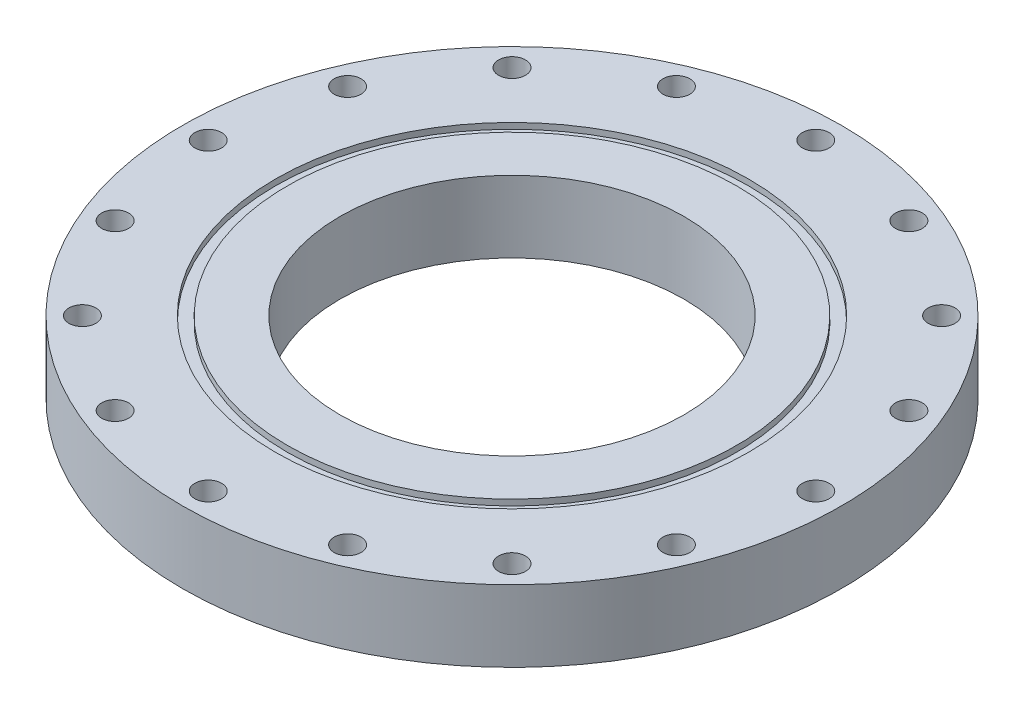
ISO-10303-21;
HEADER;
FILE_DESCRIPTION(('STEP AP214'),'2;1');
FILE_NAME('part.step','',(''),(''),'','','');
FILE_SCHEMA(('AUTOMOTIVE_DESIGN { 1 0 10303 214 1 1 1 1 }'));
ENDSEC;
DATA;
#1=APPLICATION_CONTEXT('core data for automotive mechanical design processes');
#2=APPLICATION_PROTOCOL_DEFINITION('international standard','automotive_design',2000,#1);
#3=PRODUCT_CONTEXT('',#1,'mechanical');
#4=PRODUCT('Part','Part','',(#3));
#5=PRODUCT_RELATED_PRODUCT_CATEGORY('part','',(#4));
#6=PRODUCT_DEFINITION_FORMATION('','',#4);
#7=PRODUCT_DEFINITION_CONTEXT('part definition',#1,'design');
#8=PRODUCT_DEFINITION('design','',#6,#7);
#9=PRODUCT_DEFINITION_SHAPE('','',#8);
#10=(LENGTH_UNIT() NAMED_UNIT(*) SI_UNIT(.MILLI.,.METRE.));
#11=(NAMED_UNIT(*) PLANE_ANGLE_UNIT() SI_UNIT($,.RADIAN.));
#12=(NAMED_UNIT(*) SI_UNIT($,.STERADIAN.) SOLID_ANGLE_UNIT());
#13=UNCERTAINTY_MEASURE_WITH_UNIT(LENGTH_MEASURE(1.E-05),#10,'distance_accuracy_value','');
#14=(GEOMETRIC_REPRESENTATION_CONTEXT(3) GLOBAL_UNCERTAINTY_ASSIGNED_CONTEXT((#13)) GLOBAL_UNIT_ASSIGNED_CONTEXT((#10,
#11,#12)) REPRESENTATION_CONTEXT('',''));
#15=CARTESIAN_POINT('',(0.,0.,0.));
#16=DIRECTION('',(0.,0.,1.));
#17=DIRECTION('',(1.,0.,0.));
#18=AXIS2_PLACEMENT_3D('',#15,#16,#17);
#19=CARTESIAN_POINT('',(0.,15.875,0.));
#20=DIRECTION('',(0.,1.,0.));
#21=DIRECTION('',(0.,0.,1.));
#22=AXIS2_PLACEMENT_3D('',#19,#20,#21);
#23=PLANE('',#22);
#24=CARTESIAN_POINT('',(0.,15.875,0.));
#25=DIRECTION('',(0.,1.,0.));
#26=DIRECTION('',(0.,0.,1.));
#27=AXIS2_PLACEMENT_3D('',#24,#25,#26);
#28=CIRCLE('',#27,38.1);
#29=CARTESIAN_POINT('',(0.,15.875,38.1));
#30=VERTEX_POINT('',#29);
#31=EDGE_CURVE('E49',#30,#30,#28,.T.);
#32=ORIENTED_EDGE('',*,*,#31,.F.);
#33=EDGE_LOOP('',(#32));
#34=FACE_BOUND('',#33,.T.);
#35=CARTESIAN_POINT('',(0.,15.875,0.));
#36=DIRECTION('',(0.,1.,0.));
#37=DIRECTION('',(0.,0.,1.));
#38=AXIS2_PLACEMENT_3D('',#35,#36,#37);
#39=CIRCLE('',#38,49.7967);
#40=CARTESIAN_POINT('',(0.,15.875,49.7967));
#41=VERTEX_POINT('',#40);
#42=EDGE_CURVE('E166',#41,#41,#39,.T.);
#43=ORIENTED_EDGE('',*,*,#42,.T.);
#44=EDGE_LOOP('',(#43));
#45=FACE_BOUND('',#44,.T.);
#46=ADVANCED_FACE('F35',(#34,#45),#23,.T.);
#47=CARTESIAN_POINT('',(0.,15.875,0.));
#48=DIRECTION('',(0.,1.,0.));
#49=DIRECTION('',(0.,0.,1.));
#50=AXIS2_PLACEMENT_3D('',#47,#48,#49);
#51=CIRCLE('',#50,52.4383);
#52=CARTESIAN_POINT('',(0.,15.875,52.4383));
#53=VERTEX_POINT('',#52);
#54=EDGE_CURVE('E158',#53,#53,#51,.T.);
#55=ORIENTED_EDGE('',*,*,#54,.F.);
#56=EDGE_LOOP('',(#55));
#57=FACE_BOUND('',#56,.T.);
#58=CARTESIAN_POINT('',(47.5953574416664,15.875,47.5953574416666));
#59=DIRECTION('',(0.,1.,0.));
#60=DIRECTION('',(-0.707106781186549,0.,0.707106781186546));
#61=AXIS2_PLACEMENT_3D('',#58,#59,#60);
#62=CIRCLE('',#61,2.97688);
#63=CARTESIAN_POINT('',(45.4903854068878,15.875,49.7003294764452));
#64=VERTEX_POINT('',#63);
#65=EDGE_CURVE('E115',#64,#64,#62,.T.);
#66=ORIENTED_EDGE('',*,*,#65,.F.);
#67=EDGE_LOOP('',(#66));
#68=FACE_BOUND('',#67,.T.);
#69=CARTESIAN_POINT('',(25.758421832494,15.875,62.1863313333348));
#70=DIRECTION('',(0.,1.,0.));
#71=DIRECTION('',(-0.923879532511288,0.,0.382683432365087));
#72=AXIS2_PLACEMENT_3D('',#69,#70,#71);
#73=CIRCLE('',#72,2.97688);
#74=CARTESIAN_POINT('',(23.0081433297518,15.875,63.3255339894738));
#75=VERTEX_POINT('',#74);
#76=EDGE_CURVE('E109',#75,#75,#73,.T.);
#77=ORIENTED_EDGE('',*,*,#76,.F.);
#78=EDGE_LOOP('',(#77));
#79=FACE_BOUND('',#78,.T.);
#80=CARTESIAN_POINT('',(-2.35011608917531E-13,15.875,67.31));
#81=DIRECTION('',(0.,1.,0.));
#82=DIRECTION('',(-1.,0.,0.));
#83=AXIS2_PLACEMENT_3D('',#80,#81,#82);
#84=CIRCLE('',#83,2.97688);
#85=CARTESIAN_POINT('',(-2.97688000000024,15.875,67.31));
#86=VERTEX_POINT('',#85);
#87=EDGE_CURVE('E103',#86,#86,#84,.T.);
#88=ORIENTED_EDGE('',*,*,#87,.F.);
#89=EDGE_LOOP('',(#88));
#90=FACE_BOUND('',#89,.T.);
#91=CARTESIAN_POINT('',(-25.7584218324945,15.875,62.1863313333346));
#92=DIRECTION('',(0.,1.,0.));
#93=DIRECTION('',(-0.923879532511285,0.,-0.382683432365094));
#94=AXIS2_PLACEMENT_3D('',#91,#92,#93);
#95=CIRCLE('',#94,2.97688);
#96=CARTESIAN_POINT('',(-28.5087003352367,15.875,61.0471286771956));
#97=VERTEX_POINT('',#96);
#98=EDGE_CURVE('E97',#97,#97,#95,.T.);
#99=ORIENTED_EDGE('',*,*,#98,.F.);
#100=EDGE_LOOP('',(#99));
#101=FACE_BOUND('',#100,.T.);
#102=CARTESIAN_POINT('',(-47.5953574416668,15.875,47.5953574416663));
#103=DIRECTION('',(0.,1.,0.));
#104=DIRECTION('',(-0.707106781186544,0.,-0.707106781186551));
#105=AXIS2_PLACEMENT_3D('',#102,#103,#104);
#106=CIRCLE('',#105,2.97688);
#107=CARTESIAN_POINT('',(-49.7003294764454,15.875,45.4903854068876));
#108=VERTEX_POINT('',#107);
#109=EDGE_CURVE('E90',#108,#108,#106,.T.);
#110=ORIENTED_EDGE('',*,*,#109,.F.);
#111=EDGE_LOOP('',(#110));
#112=FACE_BOUND('',#111,.T.);
#113=CARTESIAN_POINT('',(-62.1863313333349,15.875,25.7584218324938));
#114=DIRECTION('',(0.,1.,0.));
#115=DIRECTION('',(-0.382683432365084,0.,-0.923879532511289));
#116=AXIS2_PLACEMENT_3D('',#113,#114,#115);
#117=CIRCLE('',#116,2.97688);
#118=CARTESIAN_POINT('',(-63.3255339894738,15.875,23.0081433297516));
#119=VERTEX_POINT('',#118);
#120=EDGE_CURVE('E84',#119,#119,#117,.T.);
#121=ORIENTED_EDGE('',*,*,#120,.F.);
#122=EDGE_LOOP('',(#121));
#123=FACE_BOUND('',#122,.T.);
#124=CARTESIAN_POINT('',(-67.31,15.875,0.));
#125=DIRECTION('',(0.,1.,0.));
#126=DIRECTION('',(0.,0.,-1.));
#127=AXIS2_PLACEMENT_3D('',#124,#125,#126);
#128=CIRCLE('',#127,2.97688);
#129=CARTESIAN_POINT('',(-67.31,15.875,-2.97688));
#130=VERTEX_POINT('',#129);
#131=EDGE_CURVE('E78',#130,#130,#128,.T.);
#132=ORIENTED_EDGE('',*,*,#131,.F.);
#133=EDGE_LOOP('',(#132));
#134=FACE_BOUND('',#133,.T.);
#135=CARTESIAN_POINT('',(-62.1863313333345,15.875,-25.7584218324947));
#136=DIRECTION('',(0.,1.,0.));
#137=DIRECTION('',(0.382683432365097,0.,-0.923879532511284));
#138=AXIS2_PLACEMENT_3D('',#135,#136,#137);
#139=CIRCLE('',#138,2.97688);
#140=CARTESIAN_POINT('',(-61.0471286771955,15.875,-28.5087003352369));
#141=VERTEX_POINT('',#140);
#142=EDGE_CURVE('E71',#141,#141,#139,.T.);
#143=ORIENTED_EDGE('',*,*,#142,.F.);
#144=EDGE_LOOP('',(#143));
#145=FACE_BOUND('',#144,.T.);
#146=CARTESIAN_POINT('',(-47.5953574416661,15.875,-47.5953574416669));
#147=DIRECTION('',(0.,1.,0.));
#148=DIRECTION('',(0.707106781186554,0.,-0.707106781186541));
#149=AXIS2_PLACEMENT_3D('',#146,#147,#148);
#150=CIRCLE('',#149,2.97688);
#151=CARTESIAN_POINT('',(-45.4903854068875,15.875,-49.7003294764455));
#152=VERTEX_POINT('',#151);
#153=EDGE_CURVE('E153',#152,#152,#150,.T.);
#154=ORIENTED_EDGE('',*,*,#153,.F.);
#155=EDGE_LOOP('',(#154));
#156=FACE_BOUND('',#155,.T.);
#157=CARTESIAN_POINT('',(-25.7584218324936,15.875,-62.186331333335));
#158=DIRECTION('',(0.,1.,0.));
#159=DIRECTION('',(0.923879532511291,0.,-0.382683432365081));
#160=AXIS2_PLACEMENT_3D('',#157,#158,#159);
#161=CIRCLE('',#160,2.97688);
#162=CARTESIAN_POINT('',(-23.0081433297514,15.875,-63.3255339894739));
#163=VERTEX_POINT('',#162);
#164=EDGE_CURVE('E147',#163,#163,#161,.T.);
#165=ORIENTED_EDGE('',*,*,#164,.F.);
#166=EDGE_LOOP('',(#165));
#167=FACE_BOUND('',#166,.T.);
#168=CARTESIAN_POINT('',(7.05034826752594E-13,15.875,-67.31));
#169=DIRECTION('',(0.,1.,0.));
#170=DIRECTION('',(1.,0.,0.));
#171=AXIS2_PLACEMENT_3D('',#168,#169,#170);
#172=CIRCLE('',#171,2.97688);
#173=CARTESIAN_POINT('',(2.97688000000071,15.875,-67.31));
#174=VERTEX_POINT('',#173);
#175=EDGE_CURVE('E141',#174,#174,#172,.T.);
#176=ORIENTED_EDGE('',*,*,#175,.F.);
#177=EDGE_LOOP('',(#176));
#178=FACE_BOUND('',#177,.T.);
#179=CARTESIAN_POINT('',(25.7584218324949,15.875,-62.1863313333344));
#180=DIRECTION('',(0.,1.,0.));
#181=DIRECTION('',(0.923879532511283,0.,0.3826834323651));
#182=AXIS2_PLACEMENT_3D('',#179,#180,#181);
#183=CIRCLE('',#182,2.97688);
#184=CARTESIAN_POINT('',(28.5087003352371,15.875,-61.0471286771954));
#185=VERTEX_POINT('',#184);
#186=EDGE_CURVE('E135',#185,#185,#183,.T.);
#187=ORIENTED_EDGE('',*,*,#186,.F.);
#188=EDGE_LOOP('',(#187));
#189=FACE_BOUND('',#188,.T.);
#190=CARTESIAN_POINT('',(47.5953574416671,15.875,-47.5953574416659));
#191=DIRECTION('',(0.,1.,0.));
#192=DIRECTION('',(0.707106781186539,0.,0.707106781186556));
#193=AXIS2_PLACEMENT_3D('',#190,#191,#192);
#194=CIRCLE('',#193,2.97688);
#195=CARTESIAN_POINT('',(49.7003294764457,15.875,-45.4903854068873));
#196=VERTEX_POINT('',#195);
#197=EDGE_CURVE('E129',#196,#196,#194,.T.);
#198=ORIENTED_EDGE('',*,*,#197,.F.);
#199=EDGE_LOOP('',(#198));
#200=FACE_BOUND('',#199,.T.);
#201=CARTESIAN_POINT('',(62.1863313333351,15.875,-25.7584218324934));
#202=DIRECTION('',(0.,1.,0.));
#203=DIRECTION('',(0.382683432365077,0.,0.923879532511292));
#204=AXIS2_PLACEMENT_3D('',#201,#202,#203);
#205=CIRCLE('',#204,2.97688);
#206=CARTESIAN_POINT('',(63.325533989474,15.875,-23.0081433297511));
#207=VERTEX_POINT('',#206);
#208=EDGE_CURVE('E120',#207,#207,#205,.T.);
#209=ORIENTED_EDGE('',*,*,#208,.F.);
#210=EDGE_LOOP('',(#209));
#211=FACE_BOUND('',#210,.T.);
#212=CARTESIAN_POINT('',(62.1863313333347,15.875,25.7584218324942));
#213=DIRECTION('',(0.,1.,0.));
#214=DIRECTION('',(-0.382683432365091,0.,0.923879532511287));
#215=AXIS2_PLACEMENT_3D('',#212,#213,#214);
#216=CIRCLE('',#215,2.97688);
#217=CARTESIAN_POINT('',(61.0471286771957,15.875,28.5087003352365));
#218=VERTEX_POINT('',#217);
#219=EDGE_CURVE('E65',#218,#218,#216,.T.);
#220=ORIENTED_EDGE('',*,*,#219,.F.);
#221=EDGE_LOOP('',(#220));
#222=FACE_BOUND('',#221,.T.);
#223=CARTESIAN_POINT('',(67.31,15.875,0.));
#224=DIRECTION('',(0.,1.,0.));
#225=DIRECTION('',(0.,0.,1.));
#226=AXIS2_PLACEMENT_3D('',#223,#224,#225);
#227=CIRCLE('',#226,2.97688);
#228=CARTESIAN_POINT('',(67.31,15.875,2.97688));
#229=VERTEX_POINT('',#228);
#230=EDGE_CURVE('E59',#229,#229,#227,.T.);
#231=ORIENTED_EDGE('',*,*,#230,.F.);
#232=EDGE_LOOP('',(#231));
#233=FACE_BOUND('',#232,.T.);
#234=CARTESIAN_POINT('',(0.,15.875,0.));
#235=DIRECTION('',(0.,1.,0.));
#236=DIRECTION('',(0.,0.,1.));
#237=AXIS2_PLACEMENT_3D('',#234,#235,#236);
#238=CIRCLE('',#237,73.025);
#239=CARTESIAN_POINT('',(0.,15.875,73.025));
#240=VERTEX_POINT('',#239);
#241=EDGE_CURVE('E10',#240,#240,#238,.T.);
#242=ORIENTED_EDGE('',*,*,#241,.T.);
#243=EDGE_LOOP('',(#242));
#244=FACE_BOUND('',#243,.T.);
#245=ADVANCED_FACE('F190',(#57,#68,#79,#90,#101,#112,#123,#134,#145,#156,#167,#178,#189,#200,
#211,#222,#233,#244),#23,.T.);
#246=CARTESIAN_POINT('',(0.,0.,0.));
#247=DIRECTION('',(0.,1.,0.));
#248=DIRECTION('',(0.,0.,1.));
#249=AXIS2_PLACEMENT_3D('',#246,#247,#248);
#250=PLANE('',#249);
#251=CARTESIAN_POINT('',(47.5953574416664,0.,47.5953574416666));
#252=DIRECTION('',(0.,1.,0.));
#253=DIRECTION('',(-0.707106781186549,0.,0.707106781186546));
#254=AXIS2_PLACEMENT_3D('',#251,#252,#253);
#255=CIRCLE('',#254,2.97688);
#256=CARTESIAN_POINT('',(45.4903854068878,0.,49.7003294764452));
#257=VERTEX_POINT('',#256);
#258=EDGE_CURVE('E68',#257,#257,#255,.T.);
#259=ORIENTED_EDGE('',*,*,#258,.T.);
#260=EDGE_LOOP('',(#259));
#261=FACE_BOUND('',#260,.T.);
#262=CARTESIAN_POINT('',(25.758421832494,0.,62.1863313333348));
#263=DIRECTION('',(0.,1.,0.));
#264=DIRECTION('',(-0.923879532511288,0.,0.382683432365087));
#265=AXIS2_PLACEMENT_3D('',#262,#263,#264);
#266=CIRCLE('',#265,2.97688);
#267=CARTESIAN_POINT('',(23.0081433297518,0.,63.3255339894738));
#268=VERTEX_POINT('',#267);
#269=EDGE_CURVE('E112',#268,#268,#266,.T.);
#270=ORIENTED_EDGE('',*,*,#269,.T.);
#271=EDGE_LOOP('',(#270));
#272=FACE_BOUND('',#271,.T.);
#273=CARTESIAN_POINT('',(-2.35011608917531E-13,0.,67.31));
#274=DIRECTION('',(0.,1.,0.));
#275=DIRECTION('',(-1.,0.,0.));
#276=AXIS2_PLACEMENT_3D('',#273,#274,#275);
#277=CIRCLE('',#276,2.97688);
#278=CARTESIAN_POINT('',(-2.97688000000024,0.,67.31));
#279=VERTEX_POINT('',#278);
#280=EDGE_CURVE('E106',#279,#279,#277,.T.);
#281=ORIENTED_EDGE('',*,*,#280,.T.);
#282=EDGE_LOOP('',(#281));
#283=FACE_BOUND('',#282,.T.);
#284=CARTESIAN_POINT('',(-25.7584218324945,0.,62.1863313333346));
#285=DIRECTION('',(0.,1.,0.));
#286=DIRECTION('',(-0.923879532511285,0.,-0.382683432365094));
#287=AXIS2_PLACEMENT_3D('',#284,#285,#286);
#288=CIRCLE('',#287,2.97688);
#289=CARTESIAN_POINT('',(-28.5087003352367,0.,61.0471286771956));
#290=VERTEX_POINT('',#289);
#291=EDGE_CURVE('E100',#290,#290,#288,.T.);
#292=ORIENTED_EDGE('',*,*,#291,.T.);
#293=EDGE_LOOP('',(#292));
#294=FACE_BOUND('',#293,.T.);
#295=CARTESIAN_POINT('',(-47.5953574416668,0.,47.5953574416663));
#296=DIRECTION('',(0.,1.,0.));
#297=DIRECTION('',(-0.707106781186544,0.,-0.707106781186551));
#298=AXIS2_PLACEMENT_3D('',#295,#296,#297);
#299=CIRCLE('',#298,2.97688);
#300=CARTESIAN_POINT('',(-49.7003294764454,0.,45.4903854068876));
#301=VERTEX_POINT('',#300);
#302=EDGE_CURVE('E94',#301,#301,#299,.T.);
#303=ORIENTED_EDGE('',*,*,#302,.T.);
#304=EDGE_LOOP('',(#303));
#305=FACE_BOUND('',#304,.T.);
#306=CARTESIAN_POINT('',(-62.1863313333349,0.,25.7584218324938));
#307=DIRECTION('',(0.,1.,0.));
#308=DIRECTION('',(-0.382683432365084,0.,-0.923879532511289));
#309=AXIS2_PLACEMENT_3D('',#306,#307,#308);
#310=CIRCLE('',#309,2.97688);
#311=CARTESIAN_POINT('',(-63.3255339894738,0.,23.0081433297516));
#312=VERTEX_POINT('',#311);
#313=EDGE_CURVE('E87',#312,#312,#310,.T.);
#314=ORIENTED_EDGE('',*,*,#313,.T.);
#315=EDGE_LOOP('',(#314));
#316=FACE_BOUND('',#315,.T.);
#317=CARTESIAN_POINT('',(-67.31,0.,0.));
#318=DIRECTION('',(0.,1.,0.));
#319=DIRECTION('',(0.,0.,-1.));
#320=AXIS2_PLACEMENT_3D('',#317,#318,#319);
#321=CIRCLE('',#320,2.97688);
#322=CARTESIAN_POINT('',(-67.31,0.,-2.97688));
#323=VERTEX_POINT('',#322);
#324=EDGE_CURVE('E81',#323,#323,#321,.T.);
#325=ORIENTED_EDGE('',*,*,#324,.T.);
#326=EDGE_LOOP('',(#325));
#327=FACE_BOUND('',#326,.T.);
#328=CARTESIAN_POINT('',(-62.1863313333345,0.,-25.7584218324947));
#329=DIRECTION('',(0.,1.,0.));
#330=DIRECTION('',(0.382683432365097,0.,-0.923879532511284));
#331=AXIS2_PLACEMENT_3D('',#328,#329,#330);
#332=CIRCLE('',#331,2.97688);
#333=CARTESIAN_POINT('',(-61.0471286771955,0.,-28.5087003352369));
#334=VERTEX_POINT('',#333);
#335=EDGE_CURVE('E74',#334,#334,#332,.T.);
#336=ORIENTED_EDGE('',*,*,#335,.T.);
#337=EDGE_LOOP('',(#336));
#338=FACE_BOUND('',#337,.T.);
#339=CARTESIAN_POINT('',(-47.5953574416661,0.,-47.5953574416669));
#340=DIRECTION('',(0.,1.,0.));
#341=DIRECTION('',(0.707106781186554,0.,-0.707106781186541));
#342=AXIS2_PLACEMENT_3D('',#339,#340,#341);
#343=CIRCLE('',#342,2.97688);
#344=CARTESIAN_POINT('',(-45.4903854068875,0.,-49.7003294764455));
#345=VERTEX_POINT('',#344);
#346=EDGE_CURVE('E75',#345,#345,#343,.T.);
#347=ORIENTED_EDGE('',*,*,#346,.T.);
#348=EDGE_LOOP('',(#347));
#349=FACE_BOUND('',#348,.T.);
#350=CARTESIAN_POINT('',(-25.7584218324936,0.,-62.186331333335));
#351=DIRECTION('',(0.,1.,0.));
#352=DIRECTION('',(0.923879532511291,0.,-0.382683432365081));
#353=AXIS2_PLACEMENT_3D('',#350,#351,#352);
#354=CIRCLE('',#353,2.97688);
#355=CARTESIAN_POINT('',(-23.0081433297514,0.,-63.3255339894739));
#356=VERTEX_POINT('',#355);
#357=EDGE_CURVE('E150',#356,#356,#354,.T.);
#358=ORIENTED_EDGE('',*,*,#357,.T.);
#359=EDGE_LOOP('',(#358));
#360=FACE_BOUND('',#359,.T.);
#361=CARTESIAN_POINT('',(7.05034826752594E-13,0.,-67.31));
#362=DIRECTION('',(0.,1.,0.));
#363=DIRECTION('',(1.,0.,0.));
#364=AXIS2_PLACEMENT_3D('',#361,#362,#363);
#365=CIRCLE('',#364,2.97688);
#366=CARTESIAN_POINT('',(2.97688000000071,0.,-67.31));
#367=VERTEX_POINT('',#366);
#368=EDGE_CURVE('E144',#367,#367,#365,.T.);
#369=ORIENTED_EDGE('',*,*,#368,.T.);
#370=EDGE_LOOP('',(#369));
#371=FACE_BOUND('',#370,.T.);
#372=CARTESIAN_POINT('',(25.7584218324949,0.,-62.1863313333344));
#373=DIRECTION('',(0.,1.,0.));
#374=DIRECTION('',(0.923879532511283,0.,0.3826834323651));
#375=AXIS2_PLACEMENT_3D('',#372,#373,#374);
#376=CIRCLE('',#375,2.97688);
#377=CARTESIAN_POINT('',(28.5087003352371,0.,-61.0471286771954));
#378=VERTEX_POINT('',#377);
#379=EDGE_CURVE('E138',#378,#378,#376,.T.);
#380=ORIENTED_EDGE('',*,*,#379,.T.);
#381=EDGE_LOOP('',(#380));
#382=FACE_BOUND('',#381,.T.);
#383=CARTESIAN_POINT('',(47.5953574416671,0.,-47.5953574416659));
#384=DIRECTION('',(0.,1.,0.));
#385=DIRECTION('',(0.707106781186539,0.,0.707106781186556));
#386=AXIS2_PLACEMENT_3D('',#383,#384,#385);
#387=CIRCLE('',#386,2.97688);
#388=CARTESIAN_POINT('',(49.7003294764457,0.,-45.4903854068873));
#389=VERTEX_POINT('',#388);
#390=EDGE_CURVE('E132',#389,#389,#387,.T.);
#391=ORIENTED_EDGE('',*,*,#390,.T.);
#392=EDGE_LOOP('',(#391));
#393=FACE_BOUND('',#392,.T.);
#394=CARTESIAN_POINT('',(62.1863313333351,0.,-25.7584218324934));
#395=DIRECTION('',(0.,1.,0.));
#396=DIRECTION('',(0.382683432365077,0.,0.923879532511292));
#397=AXIS2_PLACEMENT_3D('',#394,#395,#396);
#398=CIRCLE('',#397,2.97688);
#399=CARTESIAN_POINT('',(63.325533989474,0.,-23.0081433297511));
#400=VERTEX_POINT('',#399);
#401=EDGE_CURVE('E124',#400,#400,#398,.T.);
#402=ORIENTED_EDGE('',*,*,#401,.T.);
#403=EDGE_LOOP('',(#402));
#404=FACE_BOUND('',#403,.T.);
#405=CARTESIAN_POINT('',(62.1863313333347,0.,25.7584218324942));
#406=DIRECTION('',(0.,1.,0.));
#407=DIRECTION('',(-0.382683432365091,0.,0.923879532511287));
#408=AXIS2_PLACEMENT_3D('',#405,#406,#407);
#409=CIRCLE('',#408,2.97688);
#410=CARTESIAN_POINT('',(61.0471286771957,0.,28.5087003352365));
#411=VERTEX_POINT('',#410);
#412=EDGE_CURVE('E62',#411,#411,#409,.T.);
#413=ORIENTED_EDGE('',*,*,#412,.T.);
#414=EDGE_LOOP('',(#413));
#415=FACE_BOUND('',#414,.T.);
#416=CARTESIAN_POINT('',(67.31,0.,0.));
#417=DIRECTION('',(0.,1.,0.));
#418=DIRECTION('',(0.,0.,1.));
#419=AXIS2_PLACEMENT_3D('',#416,#417,#418);
#420=CIRCLE('',#419,2.97688);
#421=CARTESIAN_POINT('',(67.31,0.,2.97688));
#422=VERTEX_POINT('',#421);
#423=EDGE_CURVE('E55',#422,#422,#420,.T.);
#424=ORIENTED_EDGE('',*,*,#423,.T.);
#425=EDGE_LOOP('',(#424));
#426=FACE_BOUND('',#425,.T.);
#427=CARTESIAN_POINT('',(0.,0.,0.));
#428=DIRECTION('',(0.,1.,0.));
#429=DIRECTION('',(0.,0.,1.));
#430=AXIS2_PLACEMENT_3D('',#427,#428,#429);
#431=CIRCLE('',#430,73.025);
#432=CARTESIAN_POINT('',(0.,0.,73.025));
#433=VERTEX_POINT('',#432);
#434=EDGE_CURVE('E39',#433,#433,#431,.T.);
#435=ORIENTED_EDGE('',*,*,#434,.F.);
#436=EDGE_LOOP('',(#435));
#437=FACE_BOUND('',#436,.T.);
#438=CARTESIAN_POINT('',(0.,0.,0.));
#439=DIRECTION('',(0.,1.,0.));
#440=DIRECTION('',(0.,0.,1.));
#441=AXIS2_PLACEMENT_3D('',#438,#439,#440);
#442=CIRCLE('',#441,38.1);
#443=CARTESIAN_POINT('',(0.,0.,38.1));
#444=VERTEX_POINT('',#443);
#445=EDGE_CURVE('E51',#444,#444,#442,.T.);
#446=ORIENTED_EDGE('',*,*,#445,.T.);
#447=EDGE_LOOP('',(#446));
#448=FACE_BOUND('',#447,.T.);
#449=ADVANCED_FACE('F193',(#261,#272,#283,#294,#305,#316,#327,#338,#349,#360,#371,#382,#393,
#404,#415,#426,#437,#448),#250,.F.);
#450=CARTESIAN_POINT('',(0.,15.875,0.));
#451=DIRECTION('',(0.,-1.,0.));
#452=DIRECTION('',(0.,0.,-1.));
#453=AXIS2_PLACEMENT_3D('',#450,#451,#452);
#454=CYLINDRICAL_SURFACE('',#453,73.025);
#455=ORIENTED_EDGE('',*,*,#241,.F.);
#456=EDGE_LOOP('',(#455));
#457=FACE_BOUND('',#456,.T.);
#458=ORIENTED_EDGE('',*,*,#434,.T.);
#459=EDGE_LOOP('',(#458));
#460=FACE_BOUND('',#459,.T.);
#461=ADVANCED_FACE('F37',(#457,#460),#454,.T.);
#462=CARTESIAN_POINT('',(0.,15.875,0.));
#463=DIRECTION('',(0.,-1.,0.));
#464=DIRECTION('',(0.,0.,-1.));
#465=AXIS2_PLACEMENT_3D('',#462,#463,#464);
#466=CYLINDRICAL_SURFACE('',#465,38.1);
#467=ORIENTED_EDGE('',*,*,#31,.T.);
#468=EDGE_LOOP('',(#467));
#469=FACE_BOUND('',#468,.T.);
#470=ORIENTED_EDGE('',*,*,#445,.F.);
#471=EDGE_LOOP('',(#470));
#472=FACE_BOUND('',#471,.T.);
#473=ADVANCED_FACE('F230',(#469,#472),#466,.F.);
#474=CARTESIAN_POINT('',(67.31,0.,0.));
#475=DIRECTION('',(0.,1.,0.));
#476=DIRECTION('',(0.,0.,1.));
#477=AXIS2_PLACEMENT_3D('',#474,#475,#476);
#478=CYLINDRICAL_SURFACE('',#477,2.97688);
#479=ORIENTED_EDGE('',*,*,#423,.F.);
#480=EDGE_LOOP('',(#479));
#481=FACE_BOUND('',#480,.T.);
#482=ORIENTED_EDGE('',*,*,#230,.T.);
#483=EDGE_LOOP('',(#482));
#484=FACE_BOUND('',#483,.T.);
#485=ADVANCED_FACE('F227',(#481,#484),#478,.F.);
#486=CARTESIAN_POINT('',(62.1863313333347,0.,25.7584218324942));
#487=DIRECTION('',(0.,1.,0.));
#488=DIRECTION('',(0.,0.,1.));
#489=AXIS2_PLACEMENT_3D('',#486,#487,#488);
#490=CYLINDRICAL_SURFACE('',#489,2.97688);
#491=ORIENTED_EDGE('',*,*,#412,.F.);
#492=EDGE_LOOP('',(#491));
#493=FACE_BOUND('',#492,.T.);
#494=ORIENTED_EDGE('',*,*,#219,.T.);
#495=EDGE_LOOP('',(#494));
#496=FACE_BOUND('',#495,.T.);
#497=ADVANCED_FACE('F229',(#493,#496),#490,.F.);
#498=CARTESIAN_POINT('',(62.1863313333351,0.,-25.7584218324934));
#499=DIRECTION('',(0.,1.,0.));
#500=DIRECTION('',(0.,0.,1.));
#501=AXIS2_PLACEMENT_3D('',#498,#499,#500);
#502=CYLINDRICAL_SURFACE('',#501,2.97688);
#503=ORIENTED_EDGE('',*,*,#401,.F.);
#504=EDGE_LOOP('',(#503));
#505=FACE_BOUND('',#504,.T.);
#506=ORIENTED_EDGE('',*,*,#208,.T.);
#507=EDGE_LOOP('',(#506));
#508=FACE_BOUND('',#507,.T.);
#509=ADVANCED_FACE('F237',(#505,#508),#502,.F.);
#510=CARTESIAN_POINT('',(47.5953574416671,0.,-47.5953574416659));
#511=DIRECTION('',(0.,1.,0.));
#512=DIRECTION('',(0.,0.,1.));
#513=AXIS2_PLACEMENT_3D('',#510,#511,#512);
#514=CYLINDRICAL_SURFACE('',#513,2.97688);
#515=ORIENTED_EDGE('',*,*,#390,.F.);
#516=EDGE_LOOP('',(#515));
#517=FACE_BOUND('',#516,.T.);
#518=ORIENTED_EDGE('',*,*,#197,.T.);
#519=EDGE_LOOP('',(#518));
#520=FACE_BOUND('',#519,.T.);
#521=ADVANCED_FACE('F295',(#517,#520),#514,.F.);
#522=CARTESIAN_POINT('',(25.7584218324949,0.,-62.1863313333344));
#523=DIRECTION('',(0.,1.,0.));
#524=DIRECTION('',(0.,0.,1.));
#525=AXIS2_PLACEMENT_3D('',#522,#523,#524);
#526=CYLINDRICAL_SURFACE('',#525,2.97688);
#527=ORIENTED_EDGE('',*,*,#379,.F.);
#528=EDGE_LOOP('',(#527));
#529=FACE_BOUND('',#528,.T.);
#530=ORIENTED_EDGE('',*,*,#186,.T.);
#531=EDGE_LOOP('',(#530));
#532=FACE_BOUND('',#531,.T.);
#533=ADVANCED_FACE('F300',(#529,#532),#526,.F.);
#534=CARTESIAN_POINT('',(7.05034826752594E-13,0.,-67.31));
#535=DIRECTION('',(0.,1.,0.));
#536=DIRECTION('',(0.,0.,1.));
#537=AXIS2_PLACEMENT_3D('',#534,#535,#536);
#538=CYLINDRICAL_SURFACE('',#537,2.97688);
#539=ORIENTED_EDGE('',*,*,#368,.F.);
#540=EDGE_LOOP('',(#539));
#541=FACE_BOUND('',#540,.T.);
#542=ORIENTED_EDGE('',*,*,#175,.T.);
#543=EDGE_LOOP('',(#542));
#544=FACE_BOUND('',#543,.T.);
#545=ADVANCED_FACE('F346',(#541,#544),#538,.F.);
#546=CARTESIAN_POINT('',(-25.7584218324936,0.,-62.186331333335));
#547=DIRECTION('',(0.,1.,0.));
#548=DIRECTION('',(0.,0.,1.));
#549=AXIS2_PLACEMENT_3D('',#546,#547,#548);
#550=CYLINDRICAL_SURFACE('',#549,2.97688);
#551=ORIENTED_EDGE('',*,*,#357,.F.);
#552=EDGE_LOOP('',(#551));
#553=FACE_BOUND('',#552,.T.);
#554=ORIENTED_EDGE('',*,*,#164,.T.);
#555=EDGE_LOOP('',(#554));
#556=FACE_BOUND('',#555,.T.);
#557=ADVANCED_FACE('F339',(#553,#556),#550,.F.);
#558=CARTESIAN_POINT('',(-47.5953574416661,0.,-47.5953574416669));
#559=DIRECTION('',(0.,1.,0.));
#560=DIRECTION('',(0.,0.,1.));
#561=AXIS2_PLACEMENT_3D('',#558,#559,#560);
#562=CYLINDRICAL_SURFACE('',#561,2.97688);
#563=ORIENTED_EDGE('',*,*,#346,.F.);
#564=EDGE_LOOP('',(#563));
#565=FACE_BOUND('',#564,.T.);
#566=ORIENTED_EDGE('',*,*,#153,.T.);
#567=EDGE_LOOP('',(#566));
#568=FACE_BOUND('',#567,.T.);
#569=ADVANCED_FACE('F334',(#565,#568),#562,.F.);
#570=CARTESIAN_POINT('',(-62.1863313333345,0.,-25.7584218324947));
#571=DIRECTION('',(0.,1.,0.));
#572=DIRECTION('',(0.,0.,1.));
#573=AXIS2_PLACEMENT_3D('',#570,#571,#572);
#574=CYLINDRICAL_SURFACE('',#573,2.97688);
#575=ORIENTED_EDGE('',*,*,#335,.F.);
#576=EDGE_LOOP('',(#575));
#577=FACE_BOUND('',#576,.T.);
#578=ORIENTED_EDGE('',*,*,#142,.T.);
#579=EDGE_LOOP('',(#578));
#580=FACE_BOUND('',#579,.T.);
#581=ADVANCED_FACE('F331',(#577,#580),#574,.F.);
#582=CARTESIAN_POINT('',(-67.31,0.,0.));
#583=DIRECTION('',(0.,1.,0.));
#584=DIRECTION('',(0.,0.,1.));
#585=AXIS2_PLACEMENT_3D('',#582,#583,#584);
#586=CYLINDRICAL_SURFACE('',#585,2.97688);
#587=ORIENTED_EDGE('',*,*,#324,.F.);
#588=EDGE_LOOP('',(#587));
#589=FACE_BOUND('',#588,.T.);
#590=ORIENTED_EDGE('',*,*,#131,.T.);
#591=EDGE_LOOP('',(#590));
#592=FACE_BOUND('',#591,.T.);
#593=ADVANCED_FACE('F327',(#589,#592),#586,.F.);
#594=CARTESIAN_POINT('',(-62.1863313333349,0.,25.7584218324938));
#595=DIRECTION('',(0.,1.,0.));
#596=DIRECTION('',(0.,0.,1.));
#597=AXIS2_PLACEMENT_3D('',#594,#595,#596);
#598=CYLINDRICAL_SURFACE('',#597,2.97688);
#599=ORIENTED_EDGE('',*,*,#313,.F.);
#600=EDGE_LOOP('',(#599));
#601=FACE_BOUND('',#600,.T.);
#602=ORIENTED_EDGE('',*,*,#120,.T.);
#603=EDGE_LOOP('',(#602));
#604=FACE_BOUND('',#603,.T.);
#605=ADVANCED_FACE('F323',(#601,#604),#598,.F.);
#606=CARTESIAN_POINT('',(-47.5953574416668,0.,47.5953574416663));
#607=DIRECTION('',(0.,1.,0.));
#608=DIRECTION('',(0.,0.,1.));
#609=AXIS2_PLACEMENT_3D('',#606,#607,#608);
#610=CYLINDRICAL_SURFACE('',#609,2.97688);
#611=ORIENTED_EDGE('',*,*,#302,.F.);
#612=EDGE_LOOP('',(#611));
#613=FACE_BOUND('',#612,.T.);
#614=ORIENTED_EDGE('',*,*,#109,.T.);
#615=EDGE_LOOP('',(#614));
#616=FACE_BOUND('',#615,.T.);
#617=ADVANCED_FACE('F319',(#613,#616),#610,.F.);
#618=CARTESIAN_POINT('',(-25.7584218324945,0.,62.1863313333346));
#619=DIRECTION('',(0.,1.,0.));
#620=DIRECTION('',(0.,0.,1.));
#621=AXIS2_PLACEMENT_3D('',#618,#619,#620);
#622=CYLINDRICAL_SURFACE('',#621,2.97688);
#623=ORIENTED_EDGE('',*,*,#291,.F.);
#624=EDGE_LOOP('',(#623));
#625=FACE_BOUND('',#624,.T.);
#626=ORIENTED_EDGE('',*,*,#98,.T.);
#627=EDGE_LOOP('',(#626));
#628=FACE_BOUND('',#627,.T.);
#629=ADVANCED_FACE('F315',(#625,#628),#622,.F.);
#630=CARTESIAN_POINT('',(-2.35011608917531E-13,0.,67.31));
#631=DIRECTION('',(0.,1.,0.));
#632=DIRECTION('',(0.,0.,1.));
#633=AXIS2_PLACEMENT_3D('',#630,#631,#632);
#634=CYLINDRICAL_SURFACE('',#633,2.97688);
#635=ORIENTED_EDGE('',*,*,#280,.F.);
#636=EDGE_LOOP('',(#635));
#637=FACE_BOUND('',#636,.T.);
#638=ORIENTED_EDGE('',*,*,#87,.T.);
#639=EDGE_LOOP('',(#638));
#640=FACE_BOUND('',#639,.T.);
#641=ADVANCED_FACE('F311',(#637,#640),#634,.F.);
#642=CARTESIAN_POINT('',(25.758421832494,0.,62.1863313333348));
#643=DIRECTION('',(0.,1.,0.));
#644=DIRECTION('',(0.,0.,1.));
#645=AXIS2_PLACEMENT_3D('',#642,#643,#644);
#646=CYLINDRICAL_SURFACE('',#645,2.97688);
#647=ORIENTED_EDGE('',*,*,#269,.F.);
#648=EDGE_LOOP('',(#647));
#649=FACE_BOUND('',#648,.T.);
#650=ORIENTED_EDGE('',*,*,#76,.T.);
#651=EDGE_LOOP('',(#650));
#652=FACE_BOUND('',#651,.T.);
#653=ADVANCED_FACE('F307',(#649,#652),#646,.F.);
#654=CARTESIAN_POINT('',(47.5953574416664,0.,47.5953574416666));
#655=DIRECTION('',(0.,1.,0.));
#656=DIRECTION('',(0.,0.,1.));
#657=AXIS2_PLACEMENT_3D('',#654,#655,#656);
#658=CYLINDRICAL_SURFACE('',#657,2.97688);
#659=ORIENTED_EDGE('',*,*,#258,.F.);
#660=EDGE_LOOP('',(#659));
#661=FACE_BOUND('',#660,.T.);
#662=ORIENTED_EDGE('',*,*,#65,.T.);
#663=EDGE_LOOP('',(#662));
#664=FACE_BOUND('',#663,.T.);
#665=ADVANCED_FACE('F186',(#661,#664),#658,.F.);
#666=CARTESIAN_POINT('',(0.,14.5542,0.));
#667=DIRECTION('',(0.,1.,0.));
#668=DIRECTION('',(0.,0.,1.));
#669=AXIS2_PLACEMENT_3D('',#666,#667,#668);
#670=CYLINDRICAL_SURFACE('',#669,52.4383);
#671=CARTESIAN_POINT('',(0.,14.5542,0.));
#672=DIRECTION('',(0.,1.,0.));
#673=DIRECTION('',(0.,0.,1.));
#674=AXIS2_PLACEMENT_3D('',#671,#672,#673);
#675=CIRCLE('',#674,52.4383);
#676=CARTESIAN_POINT('',(0.,14.5542,52.4383));
#677=VERTEX_POINT('',#676);
#678=EDGE_CURVE('E125',#677,#677,#675,.T.);
#679=ORIENTED_EDGE('',*,*,#678,.F.);
#680=EDGE_LOOP('',(#679));
#681=FACE_BOUND('',#680,.T.);
#682=ORIENTED_EDGE('',*,*,#54,.T.);
#683=EDGE_LOOP('',(#682));
#684=FACE_BOUND('',#683,.T.);
#685=ADVANCED_FACE('F180',(#681,#684),#670,.F.);
#686=CARTESIAN_POINT('',(0.,14.5542,0.));
#687=DIRECTION('',(0.,1.,0.));
#688=DIRECTION('',(0.,0.,1.));
#689=AXIS2_PLACEMENT_3D('',#686,#687,#688);
#690=PLANE('',#689);
#691=CARTESIAN_POINT('',(0.,14.5542,0.));
#692=DIRECTION('',(0.,1.,0.));
#693=DIRECTION('',(0.,0.,1.));
#694=AXIS2_PLACEMENT_3D('',#691,#692,#693);
#695=CIRCLE('',#694,49.7967);
#696=CARTESIAN_POINT('',(0.,14.5542,49.7967));
#697=VERTEX_POINT('',#696);
#698=EDGE_CURVE('E162',#697,#697,#695,.T.);
#699=ORIENTED_EDGE('',*,*,#698,.F.);
#700=EDGE_LOOP('',(#699));
#701=FACE_BOUND('',#700,.T.);
#702=ORIENTED_EDGE('',*,*,#678,.T.);
#703=EDGE_LOOP('',(#702));
#704=FACE_BOUND('',#703,.T.);
#705=ADVANCED_FACE('F177',(#701,#704),#690,.T.);
#706=CARTESIAN_POINT('',(0.,14.5542,0.));
#707=DIRECTION('',(0.,1.,0.));
#708=DIRECTION('',(0.,0.,1.));
#709=AXIS2_PLACEMENT_3D('',#706,#707,#708);
#710=CYLINDRICAL_SURFACE('',#709,49.7967);
#711=ORIENTED_EDGE('',*,*,#698,.T.);
#712=EDGE_LOOP('',(#711));
#713=FACE_BOUND('',#712,.T.);
#714=ORIENTED_EDGE('',*,*,#42,.F.);
#715=EDGE_LOOP('',(#714));
#716=FACE_BOUND('',#715,.T.);
#717=ADVANCED_FACE('F174',(#713,#716),#710,.T.);
#718=CLOSED_SHELL('',(#46,#245,#449,#461,#473,#485,#497,#509,#521,#533,#545,#557,#569,#581,#593,
#605,#617,#629,#641,#653,#665,#685,#705,#717));
#719=MANIFOLD_SOLID_BREP('B2',#718);
#720=ADVANCED_BREP_SHAPE_REPRESENTATION('',(#18,#719),#14);
#721=SHAPE_DEFINITION_REPRESENTATION(#9,#720);
ENDSEC;
END-ISO-10303-21;
